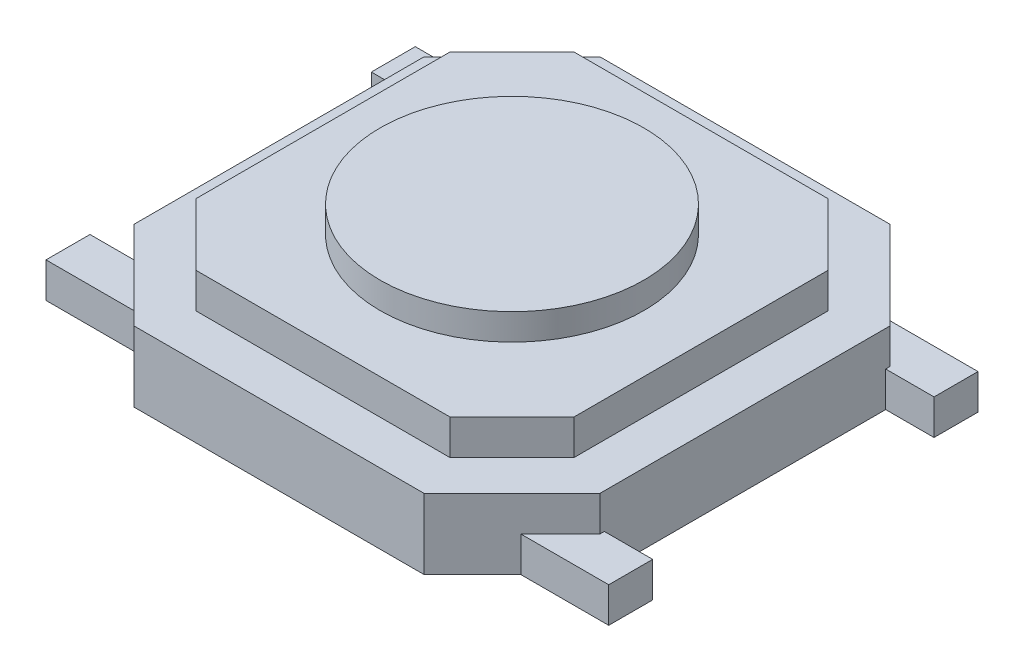
ISO-10303-21;
HEADER;
FILE_DESCRIPTION(('STEP AP214'),'2;1');
FILE_NAME('part.step','',(''),(''),'','','');
FILE_SCHEMA(('AUTOMOTIVE_DESIGN { 1 0 10303 214 1 1 1 1 }'));
ENDSEC;
DATA;
#1=APPLICATION_CONTEXT('core data for automotive mechanical design processes');
#2=APPLICATION_PROTOCOL_DEFINITION('international standard','automotive_design',2000,#1);
#3=PRODUCT_CONTEXT('',#1,'mechanical');
#4=PRODUCT('Part','Part','',(#3));
#5=PRODUCT_RELATED_PRODUCT_CATEGORY('part','',(#4));
#6=PRODUCT_DEFINITION_FORMATION('','',#4);
#7=PRODUCT_DEFINITION_CONTEXT('part definition',#1,'design');
#8=PRODUCT_DEFINITION('design','',#6,#7);
#9=PRODUCT_DEFINITION_SHAPE('','',#8);
#10=(LENGTH_UNIT() NAMED_UNIT(*) SI_UNIT(.MILLI.,.METRE.));
#11=(NAMED_UNIT(*) PLANE_ANGLE_UNIT() SI_UNIT($,.RADIAN.));
#12=(NAMED_UNIT(*) SI_UNIT($,.STERADIAN.) SOLID_ANGLE_UNIT());
#13=UNCERTAINTY_MEASURE_WITH_UNIT(LENGTH_MEASURE(1.E-05),#10,'distance_accuracy_value','');
#14=(GEOMETRIC_REPRESENTATION_CONTEXT(3) GLOBAL_UNCERTAINTY_ASSIGNED_CONTEXT((#13)) GLOBAL_UNIT_ASSIGNED_CONTEXT((#10,
#11,#12)) REPRESENTATION_CONTEXT('',''));
#15=CARTESIAN_POINT('',(0.,0.,0.));
#16=DIRECTION('',(0.,0.,1.));
#17=DIRECTION('',(1.,0.,0.));
#18=AXIS2_PLACEMENT_3D('',#15,#16,#17);
#19=CARTESIAN_POINT('',(3.59289321881346,1.2,0.));
#20=DIRECTION('',(0.,1.,0.));
#21=DIRECTION('',(0.,0.,1.));
#22=AXIS2_PLACEMENT_3D('',#19,#20,#21);
#23=PLANE('',#22);
#24=DIRECTION('',(0.707106781186549,0.,-0.707106781186546));
#25=VECTOR('',#24,1.);
#26=CARTESIAN_POINT('',(1.44289321881345,1.2,2.15));
#27=LINE('',#26,#25);
#28=CARTESIAN_POINT('',(1.44289321881345,1.2,2.15));
#29=VERTEX_POINT('',#28);
#30=CARTESIAN_POINT('',(2.15,1.2,1.44289321881345));
#31=VERTEX_POINT('',#30);
#32=EDGE_CURVE('E248',#29,#31,#27,.T.);
#33=ORIENTED_EDGE('',*,*,#32,.T.);
#34=DIRECTION('',(0.,0.,-1.));
#35=VECTOR('',#34,1.);
#36=CARTESIAN_POINT('',(2.15,1.2,1.44289321881345));
#37=LINE('',#36,#35);
#38=CARTESIAN_POINT('',(2.15,1.2,-1.44289321881346));
#39=VERTEX_POINT('',#38);
#40=EDGE_CURVE('E238',#31,#39,#37,.T.);
#41=ORIENTED_EDGE('',*,*,#40,.T.);
#42=DIRECTION('',(-0.707106781186549,0.,-0.707106781186546));
#43=VECTOR('',#42,1.);
#44=CARTESIAN_POINT('',(2.15,1.2,-1.44289321881346));
#45=LINE('',#44,#43);
#46=CARTESIAN_POINT('',(1.44289321881345,1.2,-2.15));
#47=VERTEX_POINT('',#46);
#48=EDGE_CURVE('E247',#39,#47,#45,.T.);
#49=ORIENTED_EDGE('',*,*,#48,.T.);
#50=DIRECTION('',(-1.,0.,0.));
#51=VECTOR('',#50,1.);
#52=CARTESIAN_POINT('',(1.44289321881345,1.2,-2.15));
#53=LINE('',#52,#51);
#54=CARTESIAN_POINT('',(-1.44289321881345,1.2,-2.15));
#55=VERTEX_POINT('',#54);
#56=EDGE_CURVE('E456',#47,#55,#53,.T.);
#57=ORIENTED_EDGE('',*,*,#56,.T.);
#58=DIRECTION('',(-0.707106781186549,0.,0.707106781186546));
#59=VECTOR('',#58,1.);
#60=CARTESIAN_POINT('',(-1.44289321881345,1.2,-2.15));
#61=LINE('',#60,#59);
#62=CARTESIAN_POINT('',(-2.15,1.2,-1.44289321881345));
#63=VERTEX_POINT('',#62);
#64=EDGE_CURVE('E458',#55,#63,#61,.T.);
#65=ORIENTED_EDGE('',*,*,#64,.T.);
#66=DIRECTION('',(0.,0.,1.));
#67=VECTOR('',#66,1.);
#68=CARTESIAN_POINT('',(-2.15,1.2,-1.44289321881345));
#69=LINE('',#68,#67);
#70=CARTESIAN_POINT('',(-2.15,1.2,1.44289321881346));
#71=VERTEX_POINT('',#70);
#72=EDGE_CURVE('E462',#63,#71,#69,.T.);
#73=ORIENTED_EDGE('',*,*,#72,.T.);
#74=DIRECTION('',(0.707106781186549,0.,0.707106781186546));
#75=VECTOR('',#74,1.);
#76=CARTESIAN_POINT('',(-2.15,1.2,1.44289321881346));
#77=LINE('',#76,#75);
#78=CARTESIAN_POINT('',(-1.44289321881345,1.2,2.15));
#79=VERTEX_POINT('',#78);
#80=EDGE_CURVE('E464',#71,#79,#77,.T.);
#81=ORIENTED_EDGE('',*,*,#80,.T.);
#82=DIRECTION('',(1.,0.,0.));
#83=VECTOR('',#82,1.);
#84=CARTESIAN_POINT('',(-1.44289321881345,1.2,2.15));
#85=LINE('',#84,#83);
#86=EDGE_CURVE('E253',#79,#29,#85,.T.);
#87=ORIENTED_EDGE('',*,*,#86,.T.);
#88=EDGE_LOOP('',(#33,#41,#49,#57,#65,#73,#81,#87));
#89=FACE_BOUND('',#88,.T.);
#90=CARTESIAN_POINT('',(0.,1.2,0.));
#91=DIRECTION('',(0.,1.,0.));
#92=DIRECTION('',(0.,0.,1.));
#93=AXIS2_PLACEMENT_3D('',#90,#91,#92);
#94=CIRCLE('',#93,1.5);
#95=CARTESIAN_POINT('',(0.,1.2,1.5));
#96=VERTEX_POINT('',#95);
#97=EDGE_CURVE('E36',#96,#96,#94,.F.);
#98=ORIENTED_EDGE('',*,*,#97,.T.);
#99=EDGE_LOOP('',(#98));
#100=FACE_BOUND('',#99,.T.);
#101=ADVANCED_FACE('F32',(#89,#100),#23,.T.);
#102=CARTESIAN_POINT('',(-2.65,0.8,-2.65));
#103=DIRECTION('',(0.,-1.,0.));
#104=DIRECTION('',(0.,0.,-1.));
#105=AXIS2_PLACEMENT_3D('',#102,#103,#104);
#106=PLANE('',#105);
#107=DIRECTION('',(-1.,0.,0.));
#108=VECTOR('',#107,1.);
#109=CARTESIAN_POINT('',(1.65,0.8,-2.65));
#110=LINE('',#109,#108);
#111=CARTESIAN_POINT('',(1.65,0.8,-2.65));
#112=VERTEX_POINT('',#111);
#113=CARTESIAN_POINT('',(-1.65,0.8,-2.65));
#114=VERTEX_POINT('',#113);
#115=EDGE_CURVE('E268',#112,#114,#110,.T.);
#116=ORIENTED_EDGE('',*,*,#115,.T.);
#117=DIRECTION('',(-0.707106781186549,0.,0.707106781186546));
#118=VECTOR('',#117,1.);
#119=CARTESIAN_POINT('',(-1.65,0.8,-2.65));
#120=LINE('',#119,#118);
#121=CARTESIAN_POINT('',(-2.65,0.8,-1.65));
#122=VERTEX_POINT('',#121);
#123=EDGE_CURVE('E271',#114,#122,#120,.T.);
#124=ORIENTED_EDGE('',*,*,#123,.T.);
#125=DIRECTION('',(0.,0.,1.));
#126=VECTOR('',#125,1.);
#127=CARTESIAN_POINT('',(-2.65,0.8,1.65));
#128=LINE('',#127,#126);
#129=CARTESIAN_POINT('',(-2.65,0.8,1.65));
#130=VERTEX_POINT('',#129);
#131=EDGE_CURVE('E274',#122,#130,#128,.T.);
#132=ORIENTED_EDGE('',*,*,#131,.T.);
#133=DIRECTION('',(0.707106781186549,0.,0.707106781186546));
#134=VECTOR('',#133,1.);
#135=CARTESIAN_POINT('',(-1.65,0.8,2.65));
#136=LINE('',#135,#134);
#137=CARTESIAN_POINT('',(-1.65,0.8,2.65));
#138=VERTEX_POINT('',#137);
#139=EDGE_CURVE('E276',#130,#138,#136,.T.);
#140=ORIENTED_EDGE('',*,*,#139,.T.);
#141=DIRECTION('',(1.,0.,0.));
#142=VECTOR('',#141,1.);
#143=CARTESIAN_POINT('',(1.65,0.8,2.65));
#144=LINE('',#143,#142);
#145=CARTESIAN_POINT('',(1.65,0.8,2.65));
#146=VERTEX_POINT('',#145);
#147=EDGE_CURVE('E278',#138,#146,#144,.T.);
#148=ORIENTED_EDGE('',*,*,#147,.T.);
#149=DIRECTION('',(0.707106781186548,0.,-0.707106781186546));
#150=VECTOR('',#149,1.);
#151=CARTESIAN_POINT('',(2.65,0.8,1.65));
#152=LINE('',#151,#150);
#153=CARTESIAN_POINT('',(2.65,0.8,1.65));
#154=VERTEX_POINT('',#153);
#155=EDGE_CURVE('E280',#146,#154,#152,.T.);
#156=ORIENTED_EDGE('',*,*,#155,.T.);
#157=DIRECTION('',(0.,0.,-1.));
#158=VECTOR('',#157,1.);
#159=CARTESIAN_POINT('',(2.65,0.8,1.65));
#160=LINE('',#159,#158);
#161=CARTESIAN_POINT('',(2.65,0.8,-1.65));
#162=VERTEX_POINT('',#161);
#163=EDGE_CURVE('E282',#154,#162,#160,.T.);
#164=ORIENTED_EDGE('',*,*,#163,.T.);
#165=DIRECTION('',(-0.707106781186549,0.,-0.707106781186546));
#166=VECTOR('',#165,1.);
#167=CARTESIAN_POINT('',(2.65,0.8,-1.65));
#168=LINE('',#167,#166);
#169=EDGE_CURVE('E284',#162,#112,#168,.T.);
#170=ORIENTED_EDGE('',*,*,#169,.T.);
#171=EDGE_LOOP('',(#116,#124,#132,#140,#148,#156,#164,#170));
#172=FACE_BOUND('',#171,.T.);
#173=DIRECTION('',(0.707106781186549,0.,-0.707106781186546));
#174=VECTOR('',#173,1.);
#175=CARTESIAN_POINT('',(1.79644660940672,0.8,1.79644660940673));
#176=LINE('',#175,#174);
#177=CARTESIAN_POINT('',(1.44289321881345,0.8,2.15));
#178=VERTEX_POINT('',#177);
#179=CARTESIAN_POINT('',(2.15,0.8,1.44289321881345));
#180=VERTEX_POINT('',#179);
#181=EDGE_CURVE('E11',#178,#180,#176,.T.);
#182=ORIENTED_EDGE('',*,*,#181,.F.);
#183=DIRECTION('',(1.,0.,0.));
#184=VECTOR('',#183,1.);
#185=CARTESIAN_POINT('',(-2.65,0.8,2.15));
#186=LINE('',#185,#184);
#187=CARTESIAN_POINT('',(-1.44289321881345,0.8,2.15));
#188=VERTEX_POINT('',#187);
#189=EDGE_CURVE('E435',#188,#178,#186,.T.);
#190=ORIENTED_EDGE('',*,*,#189,.F.);
#191=DIRECTION('',(0.707106781186549,0.,0.707106781186546));
#192=VECTOR('',#191,1.);
#193=CARTESIAN_POINT('',(-4.44644660940673,0.8,-0.853553390593263));
#194=LINE('',#193,#192);
#195=CARTESIAN_POINT('',(-2.15,0.8,1.44289321881346));
#196=VERTEX_POINT('',#195);
#197=EDGE_CURVE('E438',#196,#188,#194,.T.);
#198=ORIENTED_EDGE('',*,*,#197,.F.);
#199=DIRECTION('',(0.,0.,1.));
#200=VECTOR('',#199,1.);
#201=CARTESIAN_POINT('',(-2.15,0.8,-2.65));
#202=LINE('',#201,#200);
#203=CARTESIAN_POINT('',(-2.15,0.8,-1.44289321881345));
#204=VERTEX_POINT('',#203);
#205=EDGE_CURVE('E441',#204,#196,#202,.T.);
#206=ORIENTED_EDGE('',*,*,#205,.F.);
#207=DIRECTION('',(-0.707106781186549,0.,0.707106781186546));
#208=VECTOR('',#207,1.);
#209=CARTESIAN_POINT('',(-1.79644660940673,0.8,-1.79644660940673));
#210=LINE('',#209,#208);
#211=CARTESIAN_POINT('',(-1.44289321881345,0.8,-2.15));
#212=VERTEX_POINT('',#211);
#213=EDGE_CURVE('E444',#212,#204,#210,.T.);
#214=ORIENTED_EDGE('',*,*,#213,.F.);
#215=DIRECTION('',(-1.,0.,0.));
#216=VECTOR('',#215,1.);
#217=CARTESIAN_POINT('',(-2.65,0.8,-2.15));
#218=LINE('',#217,#216);
#219=CARTESIAN_POINT('',(1.44289321881345,0.8,-2.15));
#220=VERTEX_POINT('',#219);
#221=EDGE_CURVE('E447',#220,#212,#218,.T.);
#222=ORIENTED_EDGE('',*,*,#221,.F.);
#223=DIRECTION('',(-0.707106781186549,0.,-0.707106781186546));
#224=VECTOR('',#223,1.);
#225=CARTESIAN_POINT('',(-0.853553390593281,0.8,-4.44644660940673));
#226=LINE('',#225,#224);
#227=CARTESIAN_POINT('',(2.15,0.8,-1.44289321881346));
#228=VERTEX_POINT('',#227);
#229=EDGE_CURVE('E51',#228,#220,#226,.T.);
#230=ORIENTED_EDGE('',*,*,#229,.F.);
#231=DIRECTION('',(0.,0.,-1.));
#232=VECTOR('',#231,1.);
#233=CARTESIAN_POINT('',(2.15,0.8,-2.65));
#234=LINE('',#233,#232);
#235=EDGE_CURVE('E41',#180,#228,#234,.T.);
#236=ORIENTED_EDGE('',*,*,#235,.F.);
#237=EDGE_LOOP('',(#182,#190,#198,#206,#214,#222,#230,#236));
#238=FACE_BOUND('',#237,.T.);
#239=ADVANCED_FACE('F497',(#172,#238),#106,.F.);
#240=CARTESIAN_POINT('',(-3.2,0.4,-2.1));
#241=DIRECTION('',(0.,0.,1.));
#242=DIRECTION('',(1.,0.,0.));
#243=AXIS2_PLACEMENT_3D('',#240,#241,#242);
#244=PLANE('',#243);
#245=DIRECTION('',(0.,1.,0.));
#246=VECTOR('',#245,1.);
#247=CARTESIAN_POINT('',(-2.2,0.4,-2.1));
#248=LINE('',#247,#246);
#249=CARTESIAN_POINT('',(-2.2,0.,-2.1));
#250=VERTEX_POINT('',#249);
#251=CARTESIAN_POINT('',(-2.2,0.4,-2.1));
#252=VERTEX_POINT('',#251);
#253=EDGE_CURVE('E355',#250,#252,#248,.T.);
#254=ORIENTED_EDGE('',*,*,#253,.F.);
#255=DIRECTION('',(-1.,0.,0.));
#256=VECTOR('',#255,1.);
#257=CARTESIAN_POINT('',(-3.2,0.,-2.1));
#258=LINE('',#257,#256);
#259=CARTESIAN_POINT('',(-3.2,0.,-2.1));
#260=VERTEX_POINT('',#259);
#261=EDGE_CURVE('E389',#250,#260,#258,.T.);
#262=ORIENTED_EDGE('',*,*,#261,.T.);
#263=DIRECTION('',(0.,-1.,0.));
#264=VECTOR('',#263,1.);
#265=CARTESIAN_POINT('',(-3.2,0.4,-2.1));
#266=LINE('',#265,#264);
#267=CARTESIAN_POINT('',(-3.2,0.4,-2.1));
#268=VERTEX_POINT('',#267);
#269=EDGE_CURVE('E429',#268,#260,#266,.T.);
#270=ORIENTED_EDGE('',*,*,#269,.F.);
#271=DIRECTION('',(-1.,0.,0.));
#272=VECTOR('',#271,1.);
#273=CARTESIAN_POINT('',(-3.2,0.4,-2.1));
#274=LINE('',#273,#272);
#275=EDGE_CURVE('E361',#252,#268,#274,.T.);
#276=ORIENTED_EDGE('',*,*,#275,.F.);
#277=EDGE_LOOP('',(#254,#262,#270,#276));
#278=FACE_BOUND('',#277,.T.);
#279=ADVANCED_FACE('F499',(#278),#244,.F.);
#280=DIRECTION('',(0.,-1.,0.));
#281=VECTOR('',#280,1.);
#282=CARTESIAN_POINT('',(2.2,0.4,-2.1));
#283=LINE('',#282,#281);
#284=CARTESIAN_POINT('',(2.2,0.4,-2.1));
#285=VERTEX_POINT('',#284);
#286=CARTESIAN_POINT('',(2.2,0.,-2.1));
#287=VERTEX_POINT('',#286);
#288=EDGE_CURVE('E324',#285,#287,#283,.T.);
#289=ORIENTED_EDGE('',*,*,#288,.F.);
#290=CARTESIAN_POINT('',(3.2,0.4,-2.1));
#291=VERTEX_POINT('',#290);
#292=EDGE_CURVE('E363',#291,#285,#274,.T.);
#293=ORIENTED_EDGE('',*,*,#292,.F.);
#294=DIRECTION('',(0.,-1.,0.));
#295=VECTOR('',#294,1.);
#296=CARTESIAN_POINT('',(3.2,0.4,-2.1));
#297=LINE('',#296,#295);
#298=CARTESIAN_POINT('',(3.2,0.,-2.1));
#299=VERTEX_POINT('',#298);
#300=EDGE_CURVE('E432',#291,#299,#297,.T.);
#301=ORIENTED_EDGE('',*,*,#300,.T.);
#302=EDGE_CURVE('E390',#299,#287,#258,.T.);
#303=ORIENTED_EDGE('',*,*,#302,.T.);
#304=EDGE_LOOP('',(#289,#293,#301,#303));
#305=FACE_BOUND('',#304,.T.);
#306=ADVANCED_FACE('F506',(#305),#244,.F.);
#307=CARTESIAN_POINT('',(-3.2,0.4,-1.6));
#308=DIRECTION('',(0.,0.,-1.));
#309=DIRECTION('',(-1.,0.,0.));
#310=AXIS2_PLACEMENT_3D('',#307,#308,#309);
#311=PLANE('',#310);
#312=DIRECTION('',(0.,-1.,0.));
#313=VECTOR('',#312,1.);
#314=CARTESIAN_POINT('',(-2.65,0.4,-1.6));
#315=LINE('',#314,#313);
#316=CARTESIAN_POINT('',(-2.65,0.4,-1.6));
#317=VERTEX_POINT('',#316);
#318=CARTESIAN_POINT('',(-2.65,0.,-1.6));
#319=VERTEX_POINT('',#318);
#320=EDGE_CURVE('E347',#317,#319,#315,.T.);
#321=ORIENTED_EDGE('',*,*,#320,.F.);
#322=DIRECTION('',(1.,0.,0.));
#323=VECTOR('',#322,1.);
#324=CARTESIAN_POINT('',(-3.2,0.4,-1.6));
#325=LINE('',#324,#323);
#326=CARTESIAN_POINT('',(-3.2,0.4,-1.6));
#327=VERTEX_POINT('',#326);
#328=EDGE_CURVE('E368',#327,#317,#325,.T.);
#329=ORIENTED_EDGE('',*,*,#328,.F.);
#330=DIRECTION('',(0.,-1.,0.));
#331=VECTOR('',#330,1.);
#332=CARTESIAN_POINT('',(-3.2,0.4,-1.6));
#333=LINE('',#332,#331);
#334=CARTESIAN_POINT('',(-3.2,0.,-1.6));
#335=VERTEX_POINT('',#334);
#336=EDGE_CURVE('E426',#327,#335,#333,.T.);
#337=ORIENTED_EDGE('',*,*,#336,.T.);
#338=DIRECTION('',(1.,0.,0.));
#339=VECTOR('',#338,1.);
#340=CARTESIAN_POINT('',(-3.2,0.,-1.6));
#341=LINE('',#340,#339);
#342=EDGE_CURVE('E395',#335,#319,#341,.T.);
#343=ORIENTED_EDGE('',*,*,#342,.T.);
#344=EDGE_LOOP('',(#321,#329,#337,#343));
#345=FACE_BOUND('',#344,.T.);
#346=ADVANCED_FACE('F579',(#345),#311,.F.);
#347=CARTESIAN_POINT('',(-3.2,0.4,1.6));
#348=DIRECTION('',(0.,0.,1.));
#349=DIRECTION('',(1.,0.,0.));
#350=AXIS2_PLACEMENT_3D('',#347,#348,#349);
#351=PLANE('',#350);
#352=DIRECTION('',(0.,1.,0.));
#353=VECTOR('',#352,1.);
#354=CARTESIAN_POINT('',(-2.65,0.4,1.6));
#355=LINE('',#354,#353);
#356=CARTESIAN_POINT('',(-2.65,0.,1.6));
#357=VERTEX_POINT('',#356);
#358=CARTESIAN_POINT('',(-2.65,0.4,1.6));
#359=VERTEX_POINT('',#358);
#360=EDGE_CURVE('E350',#357,#359,#355,.T.);
#361=ORIENTED_EDGE('',*,*,#360,.F.);
#362=DIRECTION('',(-1.,0.,0.));
#363=VECTOR('',#362,1.);
#364=CARTESIAN_POINT('',(-3.2,0.,1.6));
#365=LINE('',#364,#363);
#366=CARTESIAN_POINT('',(-3.2,0.,1.6));
#367=VERTEX_POINT('',#366);
#368=EDGE_CURVE('E398',#357,#367,#365,.T.);
#369=ORIENTED_EDGE('',*,*,#368,.T.);
#370=DIRECTION('',(0.,-1.,0.));
#371=VECTOR('',#370,1.);
#372=CARTESIAN_POINT('',(-3.2,0.4,1.6));
#373=LINE('',#372,#371);
#374=CARTESIAN_POINT('',(-3.2,0.4,1.6));
#375=VERTEX_POINT('',#374);
#376=EDGE_CURVE('E423',#375,#367,#373,.T.);
#377=ORIENTED_EDGE('',*,*,#376,.F.);
#378=DIRECTION('',(-1.,0.,0.));
#379=VECTOR('',#378,1.);
#380=CARTESIAN_POINT('',(-3.2,0.4,1.6));
#381=LINE('',#380,#379);
#382=EDGE_CURVE('E371',#359,#375,#381,.T.);
#383=ORIENTED_EDGE('',*,*,#382,.F.);
#384=EDGE_LOOP('',(#361,#369,#377,#383));
#385=FACE_BOUND('',#384,.T.);
#386=ADVANCED_FACE('F571',(#385),#351,.F.);
#387=CARTESIAN_POINT('',(-3.2,0.4,2.1));
#388=DIRECTION('',(0.,0.,-1.));
#389=DIRECTION('',(-1.,0.,0.));
#390=AXIS2_PLACEMENT_3D('',#387,#388,#389);
#391=PLANE('',#390);
#392=DIRECTION('',(0.,-1.,0.));
#393=VECTOR('',#392,1.);
#394=CARTESIAN_POINT('',(-2.2,0.4,2.1));
#395=LINE('',#394,#393);
#396=CARTESIAN_POINT('',(-2.2,0.4,2.1));
#397=VERTEX_POINT('',#396);
#398=CARTESIAN_POINT('',(-2.2,0.,2.1));
#399=VERTEX_POINT('',#398);
#400=EDGE_CURVE('E342',#397,#399,#395,.T.);
#401=ORIENTED_EDGE('',*,*,#400,.F.);
#402=DIRECTION('',(1.,0.,0.));
#403=VECTOR('',#402,1.);
#404=CARTESIAN_POINT('',(-3.2,0.4,2.1));
#405=LINE('',#404,#403);
#406=CARTESIAN_POINT('',(-3.2,0.4,2.1));
#407=VERTEX_POINT('',#406);
#408=EDGE_CURVE('E376',#407,#397,#405,.T.);
#409=ORIENTED_EDGE('',*,*,#408,.F.);
#410=DIRECTION('',(0.,-1.,0.));
#411=VECTOR('',#410,1.);
#412=CARTESIAN_POINT('',(-3.2,0.4,2.1));
#413=LINE('',#412,#411);
#414=CARTESIAN_POINT('',(-3.2,0.,2.1));
#415=VERTEX_POINT('',#414);
#416=EDGE_CURVE('E420',#407,#415,#413,.T.);
#417=ORIENTED_EDGE('',*,*,#416,.T.);
#418=DIRECTION('',(1.,0.,0.));
#419=VECTOR('',#418,1.);
#420=CARTESIAN_POINT('',(-3.2,0.,2.1));
#421=LINE('',#420,#419);
#422=EDGE_CURVE('E403',#415,#399,#421,.T.);
#423=ORIENTED_EDGE('',*,*,#422,.T.);
#424=EDGE_LOOP('',(#401,#409,#417,#423));
#425=FACE_BOUND('',#424,.T.);
#426=ADVANCED_FACE('F568',(#425),#391,.F.);
#427=DIRECTION('',(0.,1.,0.));
#428=VECTOR('',#427,1.);
#429=CARTESIAN_POINT('',(2.2,0.4,2.1));
#430=LINE('',#429,#428);
#431=CARTESIAN_POINT('',(2.2,0.,2.1));
#432=VERTEX_POINT('',#431);
#433=CARTESIAN_POINT('',(2.2,0.4,2.1));
#434=VERTEX_POINT('',#433);
#435=EDGE_CURVE('E337',#432,#434,#430,.T.);
#436=ORIENTED_EDGE('',*,*,#435,.F.);
#437=CARTESIAN_POINT('',(3.2,0.,2.1));
#438=VERTEX_POINT('',#437);
#439=EDGE_CURVE('E402',#432,#438,#421,.T.);
#440=ORIENTED_EDGE('',*,*,#439,.T.);
#441=DIRECTION('',(0.,-1.,0.));
#442=VECTOR('',#441,1.);
#443=CARTESIAN_POINT('',(3.2,0.4,2.1));
#444=LINE('',#443,#442);
#445=CARTESIAN_POINT('',(3.2,0.4,2.1));
#446=VERTEX_POINT('',#445);
#447=EDGE_CURVE('E417',#446,#438,#444,.T.);
#448=ORIENTED_EDGE('',*,*,#447,.F.);
#449=EDGE_CURVE('E375',#434,#446,#405,.T.);
#450=ORIENTED_EDGE('',*,*,#449,.F.);
#451=EDGE_LOOP('',(#436,#440,#448,#450));
#452=FACE_BOUND('',#451,.T.);
#453=ADVANCED_FACE('F562',(#452),#391,.F.);
#454=CARTESIAN_POINT('',(3.2,0.4,1.6));
#455=DIRECTION('',(0.,0.,1.));
#456=DIRECTION('',(1.,0.,0.));
#457=AXIS2_PLACEMENT_3D('',#454,#455,#456);
#458=PLANE('',#457);
#459=DIRECTION('',(0.,-1.,0.));
#460=VECTOR('',#459,1.);
#461=CARTESIAN_POINT('',(2.65,0.4,1.6));
#462=LINE('',#461,#460);
#463=CARTESIAN_POINT('',(2.65,0.4,1.6));
#464=VERTEX_POINT('',#463);
#465=CARTESIAN_POINT('',(2.65,0.,1.6));
#466=VERTEX_POINT('',#465);
#467=EDGE_CURVE('E329',#464,#466,#462,.T.);
#468=ORIENTED_EDGE('',*,*,#467,.F.);
#469=DIRECTION('',(-1.,0.,0.));
#470=VECTOR('',#469,1.);
#471=CARTESIAN_POINT('',(3.2,0.4,1.6));
#472=LINE('',#471,#470);
#473=CARTESIAN_POINT('',(3.2,0.4,1.6));
#474=VERTEX_POINT('',#473);
#475=EDGE_CURVE('E381',#474,#464,#472,.T.);
#476=ORIENTED_EDGE('',*,*,#475,.F.);
#477=DIRECTION('',(0.,-1.,0.));
#478=VECTOR('',#477,1.);
#479=CARTESIAN_POINT('',(3.2,0.4,1.6));
#480=LINE('',#479,#478);
#481=CARTESIAN_POINT('',(3.2,0.,1.6));
#482=VERTEX_POINT('',#481);
#483=EDGE_CURVE('E414',#474,#482,#480,.T.);
#484=ORIENTED_EDGE('',*,*,#483,.T.);
#485=DIRECTION('',(-1.,0.,0.));
#486=VECTOR('',#485,1.);
#487=CARTESIAN_POINT('',(3.2,0.,1.6));
#488=LINE('',#487,#486);
#489=EDGE_CURVE('E408',#482,#466,#488,.T.);
#490=ORIENTED_EDGE('',*,*,#489,.T.);
#491=EDGE_LOOP('',(#468,#476,#484,#490));
#492=FACE_BOUND('',#491,.T.);
#493=ADVANCED_FACE('F558',(#492),#458,.F.);
#494=CARTESIAN_POINT('',(3.2,0.4,-1.6));
#495=DIRECTION('',(0.,0.,-1.));
#496=DIRECTION('',(-1.,0.,0.));
#497=AXIS2_PLACEMENT_3D('',#494,#495,#496);
#498=PLANE('',#497);
#499=DIRECTION('',(0.,1.,0.));
#500=VECTOR('',#499,1.);
#501=CARTESIAN_POINT('',(2.65,0.4,-1.6));
#502=LINE('',#501,#500);
#503=CARTESIAN_POINT('',(2.65,0.,-1.6));
#504=VERTEX_POINT('',#503);
#505=CARTESIAN_POINT('',(2.65,0.4,-1.6));
#506=VERTEX_POINT('',#505);
#507=EDGE_CURVE('E332',#504,#506,#502,.T.);
#508=ORIENTED_EDGE('',*,*,#507,.F.);
#509=DIRECTION('',(1.,0.,0.));
#510=VECTOR('',#509,1.);
#511=CARTESIAN_POINT('',(3.2,0.,-1.6));
#512=LINE('',#511,#510);
#513=CARTESIAN_POINT('',(3.2,0.,-1.6));
#514=VERTEX_POINT('',#513);
#515=EDGE_CURVE('E362',#504,#514,#512,.T.);
#516=ORIENTED_EDGE('',*,*,#515,.T.);
#517=DIRECTION('',(0.,-1.,0.));
#518=VECTOR('',#517,1.);
#519=CARTESIAN_POINT('',(3.2,0.4,-1.6));
#520=LINE('',#519,#518);
#521=CARTESIAN_POINT('',(3.2,0.4,-1.6));
#522=VERTEX_POINT('',#521);
#523=EDGE_CURVE('E386',#522,#514,#520,.T.);
#524=ORIENTED_EDGE('',*,*,#523,.F.);
#525=DIRECTION('',(1.,0.,0.));
#526=VECTOR('',#525,1.);
#527=CARTESIAN_POINT('',(3.2,0.4,-1.6));
#528=LINE('',#527,#526);
#529=EDGE_CURVE('E384',#506,#522,#528,.T.);
#530=ORIENTED_EDGE('',*,*,#529,.F.);
#531=EDGE_LOOP('',(#508,#516,#524,#530));
#532=FACE_BOUND('',#531,.T.);
#533=ADVANCED_FACE('F549',(#532),#498,.F.);
#534=CARTESIAN_POINT('',(3.2,0.4,2.1));
#535=DIRECTION('',(0.,1.,0.));
#536=DIRECTION('',(0.,0.,1.));
#537=AXIS2_PLACEMENT_3D('',#534,#535,#536);
#538=PLANE('',#537);
#539=DIRECTION('',(0.,0.,-1.));
#540=VECTOR('',#539,1.);
#541=CARTESIAN_POINT('',(-2.65,0.4,2.1));
#542=LINE('',#541,#540);
#543=CARTESIAN_POINT('',(-2.65,0.4,-1.65));
#544=VERTEX_POINT('',#543);
#545=EDGE_CURVE('E344',#317,#544,#542,.T.);
#546=ORIENTED_EDGE('',*,*,#545,.T.);
#547=DIRECTION('',(0.707106781186549,0.,-0.707106781186546));
#548=VECTOR('',#547,1.);
#549=CARTESIAN_POINT('',(-1.59999999999999,0.4,-2.70000000000001));
#550=LINE('',#549,#548);
#551=EDGE_CURVE('E352',#544,#252,#550,.T.);
#552=ORIENTED_EDGE('',*,*,#551,.T.);
#553=ORIENTED_EDGE('',*,*,#275,.T.);
#554=DIRECTION('',(0.,0.,1.));
#555=VECTOR('',#554,1.);
#556=CARTESIAN_POINT('',(-3.2,0.4,-2.1));
#557=LINE('',#556,#555);
#558=EDGE_CURVE('E366',#268,#327,#557,.T.);
#559=ORIENTED_EDGE('',*,*,#558,.T.);
#560=ORIENTED_EDGE('',*,*,#328,.T.);
#561=EDGE_LOOP('',(#546,#552,#553,#559,#560));
#562=FACE_BOUND('',#561,.T.);
#563=ADVANCED_FACE('F545',(#562),#538,.T.);
#564=DIRECTION('',(-0.707106781186549,0.,-0.707106781186546));
#565=VECTOR('',#564,1.);
#566=CARTESIAN_POINT('',(0.50000000000001,0.4,4.8));
#567=LINE('',#566,#565);
#568=CARTESIAN_POINT('',(-2.65,0.4,1.65));
#569=VERTEX_POINT('',#568);
#570=EDGE_CURVE('E339',#397,#569,#567,.T.);
#571=ORIENTED_EDGE('',*,*,#570,.T.);
#572=EDGE_CURVE('E348',#569,#359,#542,.T.);
#573=ORIENTED_EDGE('',*,*,#572,.T.);
#574=ORIENTED_EDGE('',*,*,#382,.T.);
#575=DIRECTION('',(0.,0.,1.));
#576=VECTOR('',#575,1.);
#577=CARTESIAN_POINT('',(-3.2,0.4,2.1));
#578=LINE('',#577,#576);
#579=EDGE_CURVE('E373',#375,#407,#578,.T.);
#580=ORIENTED_EDGE('',*,*,#579,.T.);
#581=ORIENTED_EDGE('',*,*,#408,.T.);
#582=EDGE_LOOP('',(#571,#573,#574,#580,#581));
#583=FACE_BOUND('',#582,.T.);
#584=ADVANCED_FACE('F548',(#583),#538,.T.);
#585=DIRECTION('',(0.,0.,1.));
#586=VECTOR('',#585,1.);
#587=CARTESIAN_POINT('',(2.65,0.4,2.1));
#588=LINE('',#587,#586);
#589=CARTESIAN_POINT('',(2.65,0.4,1.65));
#590=VERTEX_POINT('',#589);
#591=EDGE_CURVE('E326',#464,#590,#588,.T.);
#592=ORIENTED_EDGE('',*,*,#591,.T.);
#593=DIRECTION('',(-0.707106781186549,0.,0.707106781186547));
#594=VECTOR('',#593,1.);
#595=CARTESIAN_POINT('',(2.7,0.4,1.6));
#596=LINE('',#595,#594);
#597=EDGE_CURVE('E334',#590,#434,#596,.T.);
#598=ORIENTED_EDGE('',*,*,#597,.T.);
#599=ORIENTED_EDGE('',*,*,#449,.T.);
#600=DIRECTION('',(0.,0.,-1.));
#601=VECTOR('',#600,1.);
#602=CARTESIAN_POINT('',(3.2,0.4,2.1));
#603=LINE('',#602,#601);
#604=EDGE_CURVE('E379',#446,#474,#603,.T.);
#605=ORIENTED_EDGE('',*,*,#604,.T.);
#606=ORIENTED_EDGE('',*,*,#475,.T.);
#607=EDGE_LOOP('',(#592,#598,#599,#605,#606));
#608=FACE_BOUND('',#607,.T.);
#609=ADVANCED_FACE('F645',(#608),#538,.T.);
#610=DIRECTION('',(0.707106781186549,0.,0.707106781186546));
#611=VECTOR('',#610,1.);
#612=CARTESIAN_POINT('',(4.8,0.4,0.499999999999992));
#613=LINE('',#612,#611);
#614=CARTESIAN_POINT('',(2.65,0.4,-1.65));
#615=VERTEX_POINT('',#614);
#616=EDGE_CURVE('E321',#285,#615,#613,.T.);
#617=ORIENTED_EDGE('',*,*,#616,.T.);
#618=EDGE_CURVE('E330',#615,#506,#588,.T.);
#619=ORIENTED_EDGE('',*,*,#618,.T.);
#620=ORIENTED_EDGE('',*,*,#529,.T.);
#621=DIRECTION('',(0.,0.,-1.));
#622=VECTOR('',#621,1.);
#623=CARTESIAN_POINT('',(3.2,0.4,-2.1));
#624=LINE('',#623,#622);
#625=EDGE_CURVE('E358',#522,#291,#624,.T.);
#626=ORIENTED_EDGE('',*,*,#625,.T.);
#627=ORIENTED_EDGE('',*,*,#292,.T.);
#628=EDGE_LOOP('',(#617,#619,#620,#626,#627));
#629=FACE_BOUND('',#628,.T.);
#630=ADVANCED_FACE('F551',(#629),#538,.T.);
#631=CARTESIAN_POINT('',(3.2,0.4,-2.1));
#632=DIRECTION('',(-1.,0.,0.));
#633=DIRECTION('',(0.,0.,1.));
#634=AXIS2_PLACEMENT_3D('',#631,#632,#633);
#635=PLANE('',#634);
#636=DIRECTION('',(0.,0.,-1.));
#637=VECTOR('',#636,1.);
#638=CARTESIAN_POINT('',(3.2,0.,-2.1));
#639=LINE('',#638,#637);
#640=EDGE_CURVE('E357',#514,#299,#639,.T.);
#641=ORIENTED_EDGE('',*,*,#640,.T.);
#642=ORIENTED_EDGE('',*,*,#300,.F.);
#643=ORIENTED_EDGE('',*,*,#625,.F.);
#644=ORIENTED_EDGE('',*,*,#523,.T.);
#645=EDGE_LOOP('',(#641,#642,#643,#644));
#646=FACE_BOUND('',#645,.T.);
#647=ADVANCED_FACE('F34',(#646),#635,.F.);
#648=CARTESIAN_POINT('',(-3.2,0.4,-2.1));
#649=DIRECTION('',(1.,0.,0.));
#650=DIRECTION('',(0.,0.,-1.));
#651=AXIS2_PLACEMENT_3D('',#648,#649,#650);
#652=PLANE('',#651);
#653=DIRECTION('',(0.,0.,1.));
#654=VECTOR('',#653,1.);
#655=CARTESIAN_POINT('',(-3.2,0.,-2.1));
#656=LINE('',#655,#654);
#657=EDGE_CURVE('E393',#260,#335,#656,.T.);
#658=ORIENTED_EDGE('',*,*,#657,.T.);
#659=ORIENTED_EDGE('',*,*,#336,.F.);
#660=ORIENTED_EDGE('',*,*,#558,.F.);
#661=ORIENTED_EDGE('',*,*,#269,.T.);
#662=EDGE_LOOP('',(#658,#659,#660,#661));
#663=FACE_BOUND('',#662,.T.);
#664=ADVANCED_FACE('F575',(#663),#652,.F.);
#665=CARTESIAN_POINT('',(-3.2,0.4,2.1));
#666=DIRECTION('',(1.,0.,0.));
#667=DIRECTION('',(0.,0.,-1.));
#668=AXIS2_PLACEMENT_3D('',#665,#666,#667);
#669=PLANE('',#668);
#670=DIRECTION('',(0.,0.,1.));
#671=VECTOR('',#670,1.);
#672=CARTESIAN_POINT('',(-3.2,0.,2.1));
#673=LINE('',#672,#671);
#674=EDGE_CURVE('E400',#367,#415,#673,.T.);
#675=ORIENTED_EDGE('',*,*,#674,.T.);
#676=ORIENTED_EDGE('',*,*,#416,.F.);
#677=ORIENTED_EDGE('',*,*,#579,.F.);
#678=ORIENTED_EDGE('',*,*,#376,.T.);
#679=EDGE_LOOP('',(#675,#676,#677,#678));
#680=FACE_BOUND('',#679,.T.);
#681=ADVANCED_FACE('F566',(#680),#669,.F.);
#682=CARTESIAN_POINT('',(3.2,0.4,2.1));
#683=DIRECTION('',(-1.,0.,0.));
#684=DIRECTION('',(0.,0.,1.));
#685=AXIS2_PLACEMENT_3D('',#682,#683,#684);
#686=PLANE('',#685);
#687=DIRECTION('',(0.,0.,-1.));
#688=VECTOR('',#687,1.);
#689=CARTESIAN_POINT('',(3.2,0.,2.1));
#690=LINE('',#689,#688);
#691=EDGE_CURVE('E406',#438,#482,#690,.T.);
#692=ORIENTED_EDGE('',*,*,#691,.T.);
#693=ORIENTED_EDGE('',*,*,#483,.F.);
#694=ORIENTED_EDGE('',*,*,#604,.F.);
#695=ORIENTED_EDGE('',*,*,#447,.T.);
#696=EDGE_LOOP('',(#692,#693,#694,#695));
#697=FACE_BOUND('',#696,.T.);
#698=ADVANCED_FACE('F554',(#697),#686,.F.);
#699=CARTESIAN_POINT('',(3.2,0.,2.1));
#700=DIRECTION('',(0.,1.,0.));
#701=DIRECTION('',(0.,0.,1.));
#702=AXIS2_PLACEMENT_3D('',#699,#700,#701);
#703=PLANE('',#702);
#704=ORIENTED_EDGE('',*,*,#261,.F.);
#705=DIRECTION('',(-0.707106781186549,0.,0.707106781186546));
#706=VECTOR('',#705,1.);
#707=CARTESIAN_POINT('',(-1.65,0.,-2.65));
#708=LINE('',#707,#706);
#709=CARTESIAN_POINT('',(-1.65,0.,-2.65));
#710=VERTEX_POINT('',#709);
#711=EDGE_CURVE('E262',#710,#250,#708,.T.);
#712=ORIENTED_EDGE('',*,*,#711,.F.);
#713=DIRECTION('',(-1.,0.,0.));
#714=VECTOR('',#713,1.);
#715=CARTESIAN_POINT('',(1.65,0.,-2.65));
#716=LINE('',#715,#714);
#717=CARTESIAN_POINT('',(1.65,0.,-2.65));
#718=VERTEX_POINT('',#717);
#719=EDGE_CURVE('E259',#718,#710,#716,.T.);
#720=ORIENTED_EDGE('',*,*,#719,.F.);
#721=DIRECTION('',(-0.707106781186549,0.,-0.707106781186546));
#722=VECTOR('',#721,1.);
#723=CARTESIAN_POINT('',(2.65,0.,-1.65));
#724=LINE('',#723,#722);
#725=EDGE_CURVE('E272',#287,#718,#724,.T.);
#726=ORIENTED_EDGE('',*,*,#725,.F.);
#727=ORIENTED_EDGE('',*,*,#302,.F.);
#728=ORIENTED_EDGE('',*,*,#640,.F.);
#729=ORIENTED_EDGE('',*,*,#515,.F.);
#730=DIRECTION('',(0.,0.,-1.));
#731=VECTOR('',#730,1.);
#732=CARTESIAN_POINT('',(2.65,0.,1.65));
#733=LINE('',#732,#731);
#734=EDGE_CURVE('E296',#466,#504,#733,.T.);
#735=ORIENTED_EDGE('',*,*,#734,.F.);
#736=ORIENTED_EDGE('',*,*,#489,.F.);
#737=ORIENTED_EDGE('',*,*,#691,.F.);
#738=ORIENTED_EDGE('',*,*,#439,.F.);
#739=DIRECTION('',(0.707106781186548,0.,-0.707106781186546));
#740=VECTOR('',#739,1.);
#741=CARTESIAN_POINT('',(2.65,0.,1.65));
#742=LINE('',#741,#740);
#743=CARTESIAN_POINT('',(1.65,0.,2.65));
#744=VERTEX_POINT('',#743);
#745=EDGE_CURVE('E294',#744,#432,#742,.T.);
#746=ORIENTED_EDGE('',*,*,#745,.F.);
#747=DIRECTION('',(1.,0.,0.));
#748=VECTOR('',#747,1.);
#749=CARTESIAN_POINT('',(1.65,0.,2.65));
#750=LINE('',#749,#748);
#751=CARTESIAN_POINT('',(-1.65,0.,2.65));
#752=VERTEX_POINT('',#751);
#753=EDGE_CURVE('E292',#752,#744,#750,.T.);
#754=ORIENTED_EDGE('',*,*,#753,.F.);
#755=DIRECTION('',(0.707106781186549,0.,0.707106781186546));
#756=VECTOR('',#755,1.);
#757=CARTESIAN_POINT('',(-1.65,0.,2.65));
#758=LINE('',#757,#756);
#759=EDGE_CURVE('E290',#399,#752,#758,.T.);
#760=ORIENTED_EDGE('',*,*,#759,.F.);
#761=ORIENTED_EDGE('',*,*,#422,.F.);
#762=ORIENTED_EDGE('',*,*,#674,.F.);
#763=ORIENTED_EDGE('',*,*,#368,.F.);
#764=DIRECTION('',(0.,0.,1.));
#765=VECTOR('',#764,1.);
#766=CARTESIAN_POINT('',(-2.65,0.,1.65));
#767=LINE('',#766,#765);
#768=EDGE_CURVE('E288',#319,#357,#767,.T.);
#769=ORIENTED_EDGE('',*,*,#768,.F.);
#770=ORIENTED_EDGE('',*,*,#342,.F.);
#771=ORIENTED_EDGE('',*,*,#657,.F.);
#772=EDGE_LOOP('',(#704,#712,#720,#726,#727,#728,#729,#735,#736,#737,#738,#746,#754,#760,#761,
#762,#763,#769,#770,#771));
#773=FACE_BOUND('',#772,.T.);
#774=ADVANCED_FACE('F540',(#773),#703,.F.);
#775=CARTESIAN_POINT('',(-1.65,0.8,-2.65));
#776=DIRECTION('',(0.707106781186546,0.,0.707106781186549));
#777=DIRECTION('',(0.707106781186549,0.,-0.707106781186546));
#778=AXIS2_PLACEMENT_3D('',#775,#776,#777);
#779=PLANE('',#778);
#780=ORIENTED_EDGE('',*,*,#711,.T.);
#781=ORIENTED_EDGE('',*,*,#253,.T.);
#782=ORIENTED_EDGE('',*,*,#551,.F.);
#783=DIRECTION('',(0.,-1.,0.));
#784=VECTOR('',#783,1.);
#785=CARTESIAN_POINT('',(-2.65,0.8,-1.65));
#786=LINE('',#785,#784);
#787=EDGE_CURVE('E315',#122,#544,#786,.T.);
#788=ORIENTED_EDGE('',*,*,#787,.F.);
#789=ORIENTED_EDGE('',*,*,#123,.F.);
#790=DIRECTION('',(0.,-1.,0.));
#791=VECTOR('',#790,1.);
#792=CARTESIAN_POINT('',(-1.65,0.8,-2.65));
#793=LINE('',#792,#791);
#794=EDGE_CURVE('E318',#114,#710,#793,.T.);
#795=ORIENTED_EDGE('',*,*,#794,.T.);
#796=EDGE_LOOP('',(#780,#781,#782,#788,#789,#795));
#797=FACE_BOUND('',#796,.T.);
#798=ADVANCED_FACE('F536',(#797),#779,.F.);
#799=CARTESIAN_POINT('',(-2.65,0.8,1.65));
#800=DIRECTION('',(1.,0.,0.));
#801=DIRECTION('',(0.,0.,-1.));
#802=AXIS2_PLACEMENT_3D('',#799,#800,#801);
#803=PLANE('',#802);
#804=ORIENTED_EDGE('',*,*,#768,.T.);
#805=ORIENTED_EDGE('',*,*,#360,.T.);
#806=ORIENTED_EDGE('',*,*,#572,.F.);
#807=DIRECTION('',(0.,-1.,0.));
#808=VECTOR('',#807,1.);
#809=CARTESIAN_POINT('',(-2.65,0.8,1.65));
#810=LINE('',#809,#808);
#811=EDGE_CURVE('E312',#130,#569,#810,.T.);
#812=ORIENTED_EDGE('',*,*,#811,.F.);
#813=ORIENTED_EDGE('',*,*,#131,.F.);
#814=ORIENTED_EDGE('',*,*,#787,.T.);
#815=ORIENTED_EDGE('',*,*,#545,.F.);
#816=ORIENTED_EDGE('',*,*,#320,.T.);
#817=EDGE_LOOP('',(#804,#805,#806,#812,#813,#814,#815,#816));
#818=FACE_BOUND('',#817,.T.);
#819=ADVANCED_FACE('F532',(#818),#803,.F.);
#820=CARTESIAN_POINT('',(-1.65,0.8,2.65));
#821=DIRECTION('',(0.707106781186546,0.,-0.707106781186549));
#822=DIRECTION('',(-0.707106781186549,0.,-0.707106781186546));
#823=AXIS2_PLACEMENT_3D('',#820,#821,#822);
#824=PLANE('',#823);
#825=ORIENTED_EDGE('',*,*,#570,.F.);
#826=ORIENTED_EDGE('',*,*,#400,.T.);
#827=ORIENTED_EDGE('',*,*,#759,.T.);
#828=DIRECTION('',(0.,-1.,0.));
#829=VECTOR('',#828,1.);
#830=CARTESIAN_POINT('',(-1.65,0.8,2.65));
#831=LINE('',#830,#829);
#832=EDGE_CURVE('E309',#138,#752,#831,.T.);
#833=ORIENTED_EDGE('',*,*,#832,.F.);
#834=ORIENTED_EDGE('',*,*,#139,.F.);
#835=ORIENTED_EDGE('',*,*,#811,.T.);
#836=EDGE_LOOP('',(#825,#826,#827,#833,#834,#835));
#837=FACE_BOUND('',#836,.T.);
#838=ADVANCED_FACE('F524',(#837),#824,.F.);
#839=CARTESIAN_POINT('',(2.65,0.8,1.65));
#840=DIRECTION('',(-0.707106781186546,0.,-0.707106781186548));
#841=DIRECTION('',(-0.707106781186549,0.,0.707106781186547));
#842=AXIS2_PLACEMENT_3D('',#839,#840,#841);
#843=PLANE('',#842);
#844=ORIENTED_EDGE('',*,*,#745,.T.);
#845=ORIENTED_EDGE('',*,*,#435,.T.);
#846=ORIENTED_EDGE('',*,*,#597,.F.);
#847=DIRECTION('',(0.,-1.,0.));
#848=VECTOR('',#847,1.);
#849=CARTESIAN_POINT('',(2.65,0.8,1.65));
#850=LINE('',#849,#848);
#851=EDGE_CURVE('E303',#154,#590,#850,.T.);
#852=ORIENTED_EDGE('',*,*,#851,.F.);
#853=ORIENTED_EDGE('',*,*,#155,.F.);
#854=DIRECTION('',(0.,-1.,0.));
#855=VECTOR('',#854,1.);
#856=CARTESIAN_POINT('',(1.65,0.8,2.65));
#857=LINE('',#856,#855);
#858=EDGE_CURVE('E306',#146,#744,#857,.T.);
#859=ORIENTED_EDGE('',*,*,#858,.T.);
#860=EDGE_LOOP('',(#844,#845,#846,#852,#853,#859));
#861=FACE_BOUND('',#860,.T.);
#862=ADVANCED_FACE('F520',(#861),#843,.F.);
#863=CARTESIAN_POINT('',(2.65,0.8,1.65));
#864=DIRECTION('',(-1.,0.,0.));
#865=DIRECTION('',(0.,0.,1.));
#866=AXIS2_PLACEMENT_3D('',#863,#864,#865);
#867=PLANE('',#866);
#868=ORIENTED_EDGE('',*,*,#734,.T.);
#869=ORIENTED_EDGE('',*,*,#507,.T.);
#870=ORIENTED_EDGE('',*,*,#618,.F.);
#871=DIRECTION('',(0.,-1.,0.));
#872=VECTOR('',#871,1.);
#873=CARTESIAN_POINT('',(2.65,0.8,-1.65));
#874=LINE('',#873,#872);
#875=EDGE_CURVE('E301',#162,#615,#874,.T.);
#876=ORIENTED_EDGE('',*,*,#875,.F.);
#877=ORIENTED_EDGE('',*,*,#163,.F.);
#878=ORIENTED_EDGE('',*,*,#851,.T.);
#879=ORIENTED_EDGE('',*,*,#591,.F.);
#880=ORIENTED_EDGE('',*,*,#467,.T.);
#881=EDGE_LOOP('',(#868,#869,#870,#876,#877,#878,#879,#880));
#882=FACE_BOUND('',#881,.T.);
#883=ADVANCED_FACE('F516',(#882),#867,.F.);
#884=CARTESIAN_POINT('',(2.65,0.8,-1.65));
#885=DIRECTION('',(-0.707106781186546,0.,0.707106781186549));
#886=DIRECTION('',(0.707106781186549,0.,0.707106781186546));
#887=AXIS2_PLACEMENT_3D('',#884,#885,#886);
#888=PLANE('',#887);
#889=ORIENTED_EDGE('',*,*,#616,.F.);
#890=ORIENTED_EDGE('',*,*,#288,.T.);
#891=ORIENTED_EDGE('',*,*,#725,.T.);
#892=DIRECTION('',(0.,-1.,0.));
#893=VECTOR('',#892,1.);
#894=CARTESIAN_POINT('',(1.65,0.8,-2.65));
#895=LINE('',#894,#893);
#896=EDGE_CURVE('E285',#112,#718,#895,.T.);
#897=ORIENTED_EDGE('',*,*,#896,.F.);
#898=ORIENTED_EDGE('',*,*,#169,.F.);
#899=ORIENTED_EDGE('',*,*,#875,.T.);
#900=EDGE_LOOP('',(#889,#890,#891,#897,#898,#899));
#901=FACE_BOUND('',#900,.T.);
#902=ADVANCED_FACE('F512',(#901),#888,.F.);
#903=CARTESIAN_POINT('',(1.65,0.8,-2.65));
#904=DIRECTION('',(0.,0.,1.));
#905=DIRECTION('',(1.,0.,0.));
#906=AXIS2_PLACEMENT_3D('',#903,#904,#905);
#907=PLANE('',#906);
#908=ORIENTED_EDGE('',*,*,#719,.T.);
#909=ORIENTED_EDGE('',*,*,#794,.F.);
#910=ORIENTED_EDGE('',*,*,#115,.F.);
#911=ORIENTED_EDGE('',*,*,#896,.T.);
#912=EDGE_LOOP('',(#908,#909,#910,#911));
#913=FACE_BOUND('',#912,.T.);
#914=ADVANCED_FACE('F515',(#913),#907,.F.);
#915=CARTESIAN_POINT('',(1.65,0.8,2.65));
#916=DIRECTION('',(0.,0.,-1.));
#917=DIRECTION('',(-1.,0.,0.));
#918=AXIS2_PLACEMENT_3D('',#915,#916,#917);
#919=PLANE('',#918);
#920=ORIENTED_EDGE('',*,*,#753,.T.);
#921=ORIENTED_EDGE('',*,*,#858,.F.);
#922=ORIENTED_EDGE('',*,*,#147,.F.);
#923=ORIENTED_EDGE('',*,*,#832,.T.);
#924=EDGE_LOOP('',(#920,#921,#922,#923));
#925=FACE_BOUND('',#924,.T.);
#926=ADVANCED_FACE('F526',(#925),#919,.F.);
#927=CARTESIAN_POINT('',(1.44289321881345,1.2,2.15));
#928=DIRECTION('',(-0.707106781186546,0.,-0.707106781186549));
#929=DIRECTION('',(-0.707106781186549,0.,0.707106781186546));
#930=AXIS2_PLACEMENT_3D('',#927,#928,#929);
#931=PLANE('',#930);
#932=DIRECTION('',(0.,-1.,0.));
#933=VECTOR('',#932,1.);
#934=CARTESIAN_POINT('',(1.44289321881345,1.2,2.15));
#935=LINE('',#934,#933);
#936=EDGE_CURVE('E467',#29,#178,#935,.T.);
#937=ORIENTED_EDGE('',*,*,#936,.T.);
#938=ORIENTED_EDGE('',*,*,#181,.T.);
#939=DIRECTION('',(0.,-1.,0.));
#940=VECTOR('',#939,1.);
#941=CARTESIAN_POINT('',(2.15,1.2,1.44289321881345));
#942=LINE('',#941,#940);
#943=EDGE_CURVE('E242',#31,#180,#942,.T.);
#944=ORIENTED_EDGE('',*,*,#943,.F.);
#945=ORIENTED_EDGE('',*,*,#32,.F.);
#946=EDGE_LOOP('',(#937,#938,#944,#945));
#947=FACE_BOUND('',#946,.T.);
#948=ADVANCED_FACE('F258',(#947),#931,.F.);
#949=CARTESIAN_POINT('',(2.15,1.2,1.44289321881345));
#950=DIRECTION('',(-1.,0.,0.));
#951=DIRECTION('',(0.,0.,1.));
#952=AXIS2_PLACEMENT_3D('',#949,#950,#951);
#953=PLANE('',#952);
#954=ORIENTED_EDGE('',*,*,#943,.T.);
#955=ORIENTED_EDGE('',*,*,#235,.T.);
#956=DIRECTION('',(0.,-1.,0.));
#957=VECTOR('',#956,1.);
#958=CARTESIAN_POINT('',(2.15,1.2,-1.44289321881346));
#959=LINE('',#958,#957);
#960=EDGE_CURVE('E244',#39,#228,#959,.T.);
#961=ORIENTED_EDGE('',*,*,#960,.F.);
#962=ORIENTED_EDGE('',*,*,#40,.F.);
#963=EDGE_LOOP('',(#954,#955,#961,#962));
#964=FACE_BOUND('',#963,.T.);
#965=ADVANCED_FACE('F240',(#964),#953,.F.);
#966=CARTESIAN_POINT('',(2.15,1.2,-1.44289321881346));
#967=DIRECTION('',(-0.707106781186546,0.,0.707106781186549));
#968=DIRECTION('',(0.707106781186549,0.,0.707106781186546));
#969=AXIS2_PLACEMENT_3D('',#966,#967,#968);
#970=PLANE('',#969);
#971=ORIENTED_EDGE('',*,*,#960,.T.);
#972=ORIENTED_EDGE('',*,*,#229,.T.);
#973=DIRECTION('',(0.,-1.,0.));
#974=VECTOR('',#973,1.);
#975=CARTESIAN_POINT('',(1.44289321881345,1.2,-2.15));
#976=LINE('',#975,#974);
#977=EDGE_CURVE('E264',#47,#220,#976,.T.);
#978=ORIENTED_EDGE('',*,*,#977,.F.);
#979=ORIENTED_EDGE('',*,*,#48,.F.);
#980=EDGE_LOOP('',(#971,#972,#978,#979));
#981=FACE_BOUND('',#980,.T.);
#982=ADVANCED_FACE('F452',(#981),#970,.F.);
#983=CARTESIAN_POINT('',(1.44289321881345,1.2,-2.15));
#984=DIRECTION('',(0.,0.,1.));
#985=DIRECTION('',(1.,0.,0.));
#986=AXIS2_PLACEMENT_3D('',#983,#984,#985);
#987=PLANE('',#986);
#988=ORIENTED_EDGE('',*,*,#977,.T.);
#989=ORIENTED_EDGE('',*,*,#221,.T.);
#990=DIRECTION('',(0.,-1.,0.));
#991=VECTOR('',#990,1.);
#992=CARTESIAN_POINT('',(-1.44289321881345,1.2,-2.15));
#993=LINE('',#992,#991);
#994=EDGE_CURVE('E478',#55,#212,#993,.T.);
#995=ORIENTED_EDGE('',*,*,#994,.F.);
#996=ORIENTED_EDGE('',*,*,#56,.F.);
#997=EDGE_LOOP('',(#988,#989,#995,#996));
#998=FACE_BOUND('',#997,.T.);
#999=ADVANCED_FACE('F481',(#998),#987,.F.);
#1000=CARTESIAN_POINT('',(-1.44289321881345,1.2,-2.15));
#1001=DIRECTION('',(0.707106781186546,0.,0.707106781186549));
#1002=DIRECTION('',(0.707106781186549,0.,-0.707106781186546));
#1003=AXIS2_PLACEMENT_3D('',#1000,#1001,#1002);
#1004=PLANE('',#1003);
#1005=ORIENTED_EDGE('',*,*,#994,.T.);
#1006=ORIENTED_EDGE('',*,*,#213,.T.);
#1007=DIRECTION('',(0.,-1.,0.));
#1008=VECTOR('',#1007,1.);
#1009=CARTESIAN_POINT('',(-2.15,1.2,-1.44289321881345));
#1010=LINE('',#1009,#1008);
#1011=EDGE_CURVE('E475',#63,#204,#1010,.T.);
#1012=ORIENTED_EDGE('',*,*,#1011,.F.);
#1013=ORIENTED_EDGE('',*,*,#64,.F.);
#1014=EDGE_LOOP('',(#1005,#1006,#1012,#1013));
#1015=FACE_BOUND('',#1014,.T.);
#1016=ADVANCED_FACE('F488',(#1015),#1004,.F.);
#1017=CARTESIAN_POINT('',(-2.15,1.2,-1.44289321881345));
#1018=DIRECTION('',(1.,0.,0.));
#1019=DIRECTION('',(0.,0.,-1.));
#1020=AXIS2_PLACEMENT_3D('',#1017,#1018,#1019);
#1021=PLANE('',#1020);
#1022=ORIENTED_EDGE('',*,*,#1011,.T.);
#1023=ORIENTED_EDGE('',*,*,#205,.T.);
#1024=DIRECTION('',(0.,-1.,0.));
#1025=VECTOR('',#1024,1.);
#1026=CARTESIAN_POINT('',(-2.15,1.2,1.44289321881346));
#1027=LINE('',#1026,#1025);
#1028=EDGE_CURVE('E472',#71,#196,#1027,.T.);
#1029=ORIENTED_EDGE('',*,*,#1028,.F.);
#1030=ORIENTED_EDGE('',*,*,#72,.F.);
#1031=EDGE_LOOP('',(#1022,#1023,#1029,#1030));
#1032=FACE_BOUND('',#1031,.T.);
#1033=ADVANCED_FACE('F490',(#1032),#1021,.F.);
#1034=CARTESIAN_POINT('',(-2.15,1.2,1.44289321881346));
#1035=DIRECTION('',(0.707106781186546,0.,-0.707106781186549));
#1036=DIRECTION('',(-0.707106781186549,0.,-0.707106781186546));
#1037=AXIS2_PLACEMENT_3D('',#1034,#1035,#1036);
#1038=PLANE('',#1037);
#1039=ORIENTED_EDGE('',*,*,#1028,.T.);
#1040=ORIENTED_EDGE('',*,*,#197,.T.);
#1041=DIRECTION('',(0.,-1.,0.));
#1042=VECTOR('',#1041,1.);
#1043=CARTESIAN_POINT('',(-1.44289321881345,1.2,2.15));
#1044=LINE('',#1043,#1042);
#1045=EDGE_CURVE('E469',#79,#188,#1044,.T.);
#1046=ORIENTED_EDGE('',*,*,#1045,.F.);
#1047=ORIENTED_EDGE('',*,*,#80,.F.);
#1048=EDGE_LOOP('',(#1039,#1040,#1046,#1047));
#1049=FACE_BOUND('',#1048,.T.);
#1050=ADVANCED_FACE('F494',(#1049),#1038,.F.);
#1051=CARTESIAN_POINT('',(-1.44289321881345,1.2,2.15));
#1052=DIRECTION('',(0.,0.,-1.));
#1053=DIRECTION('',(-1.,0.,0.));
#1054=AXIS2_PLACEMENT_3D('',#1051,#1052,#1053);
#1055=PLANE('',#1054);
#1056=ORIENTED_EDGE('',*,*,#1045,.T.);
#1057=ORIENTED_EDGE('',*,*,#189,.T.);
#1058=ORIENTED_EDGE('',*,*,#936,.F.);
#1059=ORIENTED_EDGE('',*,*,#86,.F.);
#1060=EDGE_LOOP('',(#1056,#1057,#1058,#1059));
#1061=FACE_BOUND('',#1060,.T.);
#1062=ADVANCED_FACE('F496',(#1061),#1055,.F.);
#1063=CARTESIAN_POINT('',(0.,1.5,0.));
#1064=DIRECTION('',(0.,-1.,0.));
#1065=DIRECTION('',(0.,0.,-1.));
#1066=AXIS2_PLACEMENT_3D('',#1063,#1064,#1065);
#1067=CYLINDRICAL_SURFACE('',#1066,1.5);
#1068=ORIENTED_EDGE('',*,*,#97,.F.);
#1069=EDGE_LOOP('',(#1068));
#1070=FACE_BOUND('',#1069,.T.);
#1071=CARTESIAN_POINT('',(0.,1.5,0.));
#1072=DIRECTION('',(0.,1.,0.));
#1073=DIRECTION('',(0.,0.,1.));
#1074=AXIS2_PLACEMENT_3D('',#1071,#1072,#1073);
#1075=CIRCLE('',#1074,1.5);
#1076=CARTESIAN_POINT('',(0.,1.5,1.5));
#1077=VERTEX_POINT('',#1076);
#1078=EDGE_CURVE('E912',#1077,#1077,#1075,.T.);
#1079=ORIENTED_EDGE('',*,*,#1078,.F.);
#1080=EDGE_LOOP('',(#1079));
#1081=FACE_BOUND('',#1080,.T.);
#1082=ADVANCED_FACE('F865',(#1070,#1081),#1067,.T.);
#1083=CARTESIAN_POINT('',(0.,1.5,0.));
#1084=DIRECTION('',(0.,1.,0.));
#1085=DIRECTION('',(0.,0.,1.));
#1086=AXIS2_PLACEMENT_3D('',#1083,#1084,#1085);
#1087=PLANE('',#1086);
#1088=ORIENTED_EDGE('',*,*,#1078,.T.);
#1089=EDGE_LOOP('',(#1088));
#1090=FACE_BOUND('',#1089,.T.);
#1091=ADVANCED_FACE('F876',(#1090),#1087,.T.);
#1092=CLOSED_SHELL('',(#101,#239,#279,#306,#346,#386,#426,#453,#493,#533,#563,#584,#609,#630,
#647,#664,#681,#698,#774,#798,#819,#838,#862,#883,#902,#914,#926,#948,#965,#982,#999,#1016,
#1033,#1050,#1062,#1082,#1091));
#1093=MANIFOLD_SOLID_BREP('B2',#1092);
#1094=ADVANCED_BREP_SHAPE_REPRESENTATION('',(#18,#1093),#14);
#1095=SHAPE_DEFINITION_REPRESENTATION(#9,#1094);
ENDSEC;
END-ISO-10303-21;
